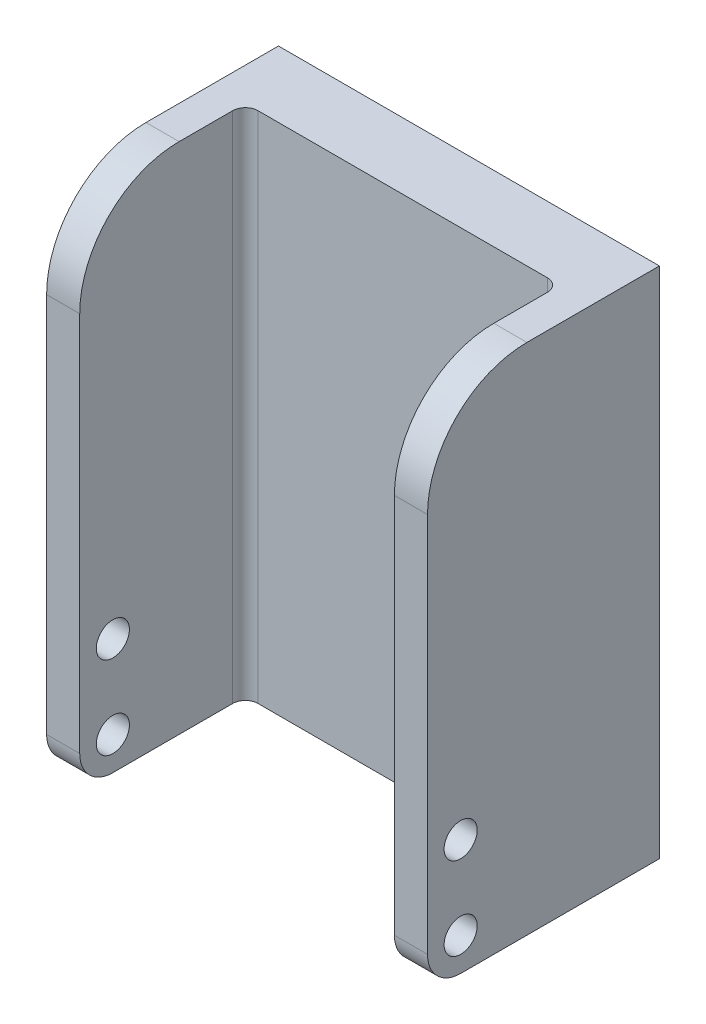
ISO-10303-21;
HEADER;
FILE_DESCRIPTION(('STEP AP214'),'2;1');
FILE_NAME('part.step','',(''),(''),'','','');
FILE_SCHEMA(('AUTOMOTIVE_DESIGN { 1 0 10303 214 1 1 1 1 }'));
ENDSEC;
DATA;
#1=APPLICATION_CONTEXT('core data for automotive mechanical design processes');
#2=APPLICATION_PROTOCOL_DEFINITION('international standard','automotive_design',2000,#1);
#3=PRODUCT_CONTEXT('',#1,'mechanical');
#4=PRODUCT('Part','Part','',(#3));
#5=PRODUCT_RELATED_PRODUCT_CATEGORY('part','',(#4));
#6=PRODUCT_DEFINITION_FORMATION('','',#4);
#7=PRODUCT_DEFINITION_CONTEXT('part definition',#1,'design');
#8=PRODUCT_DEFINITION('design','',#6,#7);
#9=PRODUCT_DEFINITION_SHAPE('','',#8);
#10=(LENGTH_UNIT() NAMED_UNIT(*) SI_UNIT(.MILLI.,.METRE.));
#11=(NAMED_UNIT(*) PLANE_ANGLE_UNIT() SI_UNIT($,.RADIAN.));
#12=(NAMED_UNIT(*) SI_UNIT($,.STERADIAN.) SOLID_ANGLE_UNIT());
#13=UNCERTAINTY_MEASURE_WITH_UNIT(LENGTH_MEASURE(1.E-05),#10,'distance_accuracy_value','');
#14=(GEOMETRIC_REPRESENTATION_CONTEXT(3) GLOBAL_UNCERTAINTY_ASSIGNED_CONTEXT((#13)) GLOBAL_UNIT_ASSIGNED_CONTEXT((#10,
#11,#12)) REPRESENTATION_CONTEXT('',''));
#15=CARTESIAN_POINT('',(0.,0.,0.));
#16=DIRECTION('',(0.,0.,1.));
#17=DIRECTION('',(1.,0.,0.));
#18=AXIS2_PLACEMENT_3D('',#15,#16,#17);
#19=CARTESIAN_POINT('',(0.,0.,4.));
#20=DIRECTION('',(0.,0.,-1.));
#21=DIRECTION('',(-1.,0.,0.));
#22=AXIS2_PLACEMENT_3D('',#19,#20,#21);
#23=PLANE('',#22);
#24=DIRECTION('',(-1.,0.,0.));
#25=VECTOR('',#24,1.);
#26=CARTESIAN_POINT('',(-11.5,15.5,4.));
#27=LINE('',#26,#25);
#28=CARTESIAN_POINT('',(8.738,15.5,4.));
#29=VERTEX_POINT('',#28);
#30=CARTESIAN_POINT('',(-8.738,15.5,4.));
#31=VERTEX_POINT('',#30);
#32=EDGE_CURVE('E172',#29,#31,#27,.T.);
#33=ORIENTED_EDGE('',*,*,#32,.T.);
#34=DIRECTION('',(0.,1.,0.));
#35=VECTOR('',#34,1.);
#36=CARTESIAN_POINT('',(-8.738,-15.5,4.));
#37=LINE('',#36,#35);
#38=CARTESIAN_POINT('',(-8.738,-15.5,4.));
#39=VERTEX_POINT('',#38);
#40=EDGE_CURVE('E230',#31,#39,#37,.F.);
#41=ORIENTED_EDGE('',*,*,#40,.T.);
#42=DIRECTION('',(1.,0.,0.));
#43=VECTOR('',#42,1.);
#44=CARTESIAN_POINT('',(-11.5,-15.5,4.));
#45=LINE('',#44,#43);
#46=CARTESIAN_POINT('',(8.738,-15.5,4.));
#47=VERTEX_POINT('',#46);
#48=EDGE_CURVE('E166',#39,#47,#45,.T.);
#49=ORIENTED_EDGE('',*,*,#48,.T.);
#50=DIRECTION('',(0.,1.,0.));
#51=VECTOR('',#50,1.);
#52=CARTESIAN_POINT('',(8.738,15.5,4.));
#53=LINE('',#52,#51);
#54=EDGE_CURVE('E227',#47,#29,#53,.T.);
#55=ORIENTED_EDGE('',*,*,#54,.T.);
#56=EDGE_LOOP('',(#33,#41,#49,#55));
#57=FACE_BOUND('',#56,.T.);
#58=ADVANCED_FACE('F36',(#57),#23,.F.);
#59=CARTESIAN_POINT('',(11.5,-15.5,4.));
#60=DIRECTION('',(-1.,0.,0.));
#61=DIRECTION('',(0.,0.,1.));
#62=AXIS2_PLACEMENT_3D('',#59,#60,#61);
#63=PLANE('',#62);
#64=CARTESIAN_POINT('',(11.5,-8.5,12.));
#65=DIRECTION('',(1.,0.,0.));
#66=DIRECTION('',(0.,0.,-1.));
#67=AXIS2_PLACEMENT_3D('',#64,#65,#66);
#68=CIRCLE('',#67,1.);
#69=CARTESIAN_POINT('',(11.5,-8.5,11.));
#70=VERTEX_POINT('',#69);
#71=EDGE_CURVE('E279',#70,#70,#68,.T.);
#72=ORIENTED_EDGE('',*,*,#71,.F.);
#73=EDGE_LOOP('',(#72));
#74=FACE_BOUND('',#73,.T.);
#75=CARTESIAN_POINT('',(11.5,-13.5,12.));
#76=DIRECTION('',(1.,0.,0.));
#77=DIRECTION('',(0.,0.,-1.));
#78=AXIS2_PLACEMENT_3D('',#75,#76,#77);
#79=CIRCLE('',#78,1.);
#80=CARTESIAN_POINT('',(11.5,-13.5,11.));
#81=VERTEX_POINT('',#80);
#82=EDGE_CURVE('E273',#81,#81,#79,.T.);
#83=ORIENTED_EDGE('',*,*,#82,.F.);
#84=EDGE_LOOP('',(#83));
#85=FACE_BOUND('',#84,.T.);
#86=DIRECTION('',(0.,0.,-1.));
#87=VECTOR('',#86,1.);
#88=CARTESIAN_POINT('',(11.5,15.5,4.));
#89=LINE('',#88,#87);
#90=CARTESIAN_POINT('',(11.5,15.5,8.));
#91=VERTEX_POINT('',#90);
#92=CARTESIAN_POINT('',(11.5,15.5,0.));
#93=VERTEX_POINT('',#92);
#94=EDGE_CURVE('E136',#91,#93,#89,.T.);
#95=ORIENTED_EDGE('',*,*,#94,.F.);
#96=CARTESIAN_POINT('',(11.5,9.5,8.));
#97=DIRECTION('',(-1.,0.,0.));
#98=DIRECTION('',(0.,0.,1.));
#99=AXIS2_PLACEMENT_3D('',#96,#97,#98);
#100=CIRCLE('',#99,6.);
#101=CARTESIAN_POINT('',(11.5,9.5,14.));
#102=VERTEX_POINT('',#101);
#103=EDGE_CURVE('E217',#91,#102,#100,.F.);
#104=ORIENTED_EDGE('',*,*,#103,.T.);
#105=DIRECTION('',(0.,-1.,0.));
#106=VECTOR('',#105,1.);
#107=CARTESIAN_POINT('',(11.5,15.5,14.));
#108=LINE('',#107,#106);
#109=CARTESIAN_POINT('',(11.5,-13.5,14.));
#110=VERTEX_POINT('',#109);
#111=EDGE_CURVE('E261',#102,#110,#108,.T.);
#112=ORIENTED_EDGE('',*,*,#111,.T.);
#113=CARTESIAN_POINT('',(11.5,-13.5,12.));
#114=DIRECTION('',(-1.,0.,0.));
#115=DIRECTION('',(0.,0.,1.));
#116=AXIS2_PLACEMENT_3D('',#113,#114,#115);
#117=CIRCLE('',#116,2.);
#118=CARTESIAN_POINT('',(11.5,-15.5,12.));
#119=VERTEX_POINT('',#118);
#120=EDGE_CURVE('E201',#110,#119,#117,.F.);
#121=ORIENTED_EDGE('',*,*,#120,.T.);
#122=DIRECTION('',(0.,0.,-1.));
#123=VECTOR('',#122,1.);
#124=CARTESIAN_POINT('',(11.5,-15.5,4.));
#125=LINE('',#124,#123);
#126=CARTESIAN_POINT('',(11.5,-15.5,0.));
#127=VERTEX_POINT('',#126);
#128=EDGE_CURVE('E159',#119,#127,#125,.T.);
#129=ORIENTED_EDGE('',*,*,#128,.T.);
#130=DIRECTION('',(0.,1.,0.));
#131=VECTOR('',#130,1.);
#132=CARTESIAN_POINT('',(11.5,-15.5,0.));
#133=LINE('',#132,#131);
#134=EDGE_CURVE('E153',#127,#93,#133,.T.);
#135=ORIENTED_EDGE('',*,*,#134,.T.);
#136=EDGE_LOOP('',(#95,#104,#112,#121,#129,#135));
#137=FACE_BOUND('',#136,.T.);
#138=ADVANCED_FACE('F157',(#74,#85,#137),#63,.F.);
#139=CARTESIAN_POINT('',(-11.5,15.5,4.));
#140=DIRECTION('',(0.,-1.,0.));
#141=DIRECTION('',(0.,0.,-1.));
#142=AXIS2_PLACEMENT_3D('',#139,#140,#141);
#143=PLANE('',#142);
#144=DIRECTION('',(0.,0.,-1.));
#145=VECTOR('',#144,1.);
#146=CARTESIAN_POINT('',(-11.5,15.5,4.));
#147=LINE('',#146,#145);
#148=CARTESIAN_POINT('',(-11.5,15.5,8.));
#149=VERTEX_POINT('',#148);
#150=CARTESIAN_POINT('',(-11.5,15.5,0.));
#151=VERTEX_POINT('',#150);
#152=EDGE_CURVE('E147',#149,#151,#147,.T.);
#153=ORIENTED_EDGE('',*,*,#152,.F.);
#154=DIRECTION('',(-1.,0.,0.));
#155=VECTOR('',#154,1.);
#156=CARTESIAN_POINT('',(-11.5,15.5,8.));
#157=LINE('',#156,#155);
#158=CARTESIAN_POINT('',(-9.5,15.5,8.));
#159=VERTEX_POINT('',#158);
#160=EDGE_CURVE('E212',#149,#159,#157,.F.);
#161=ORIENTED_EDGE('',*,*,#160,.T.);
#162=DIRECTION('',(0.,0.,1.));
#163=VECTOR('',#162,1.);
#164=CARTESIAN_POINT('',(-9.5,15.5,4.));
#165=LINE('',#164,#163);
#166=CARTESIAN_POINT('',(-9.5,15.5,4.762));
#167=VERTEX_POINT('',#166);
#168=EDGE_CURVE('E257',#167,#159,#165,.T.);
#169=ORIENTED_EDGE('',*,*,#168,.F.);
#170=CARTESIAN_POINT('',(-8.738,15.5,4.762));
#171=DIRECTION('',(0.,-1.,0.));
#172=DIRECTION('',(0.,0.,-1.));
#173=AXIS2_PLACEMENT_3D('',#170,#171,#172);
#174=CIRCLE('',#173,0.762);
#175=EDGE_CURVE('E233',#167,#31,#174,.T.);
#176=ORIENTED_EDGE('',*,*,#175,.T.);
#177=ORIENTED_EDGE('',*,*,#32,.F.);
#178=CARTESIAN_POINT('',(8.738,15.5,4.762));
#179=DIRECTION('',(0.,-1.,0.));
#180=DIRECTION('',(0.,0.,-1.));
#181=AXIS2_PLACEMENT_3D('',#178,#179,#180);
#182=CIRCLE('',#181,0.762);
#183=CARTESIAN_POINT('',(9.5,15.5,4.762));
#184=VERTEX_POINT('',#183);
#185=EDGE_CURVE('E44',#29,#184,#182,.T.);
#186=ORIENTED_EDGE('',*,*,#185,.T.);
#187=DIRECTION('',(0.,0.,1.));
#188=VECTOR('',#187,1.);
#189=CARTESIAN_POINT('',(9.5,15.5,4.));
#190=LINE('',#189,#188);
#191=CARTESIAN_POINT('',(9.5,15.5,8.));
#192=VERTEX_POINT('',#191);
#193=EDGE_CURVE('E262',#184,#192,#190,.T.);
#194=ORIENTED_EDGE('',*,*,#193,.T.);
#195=DIRECTION('',(1.,0.,0.));
#196=VECTOR('',#195,1.);
#197=CARTESIAN_POINT('',(11.5,15.5,8.));
#198=LINE('',#197,#196);
#199=EDGE_CURVE('E143',#192,#91,#198,.T.);
#200=ORIENTED_EDGE('',*,*,#199,.T.);
#201=ORIENTED_EDGE('',*,*,#94,.T.);
#202=DIRECTION('',(-1.,0.,0.));
#203=VECTOR('',#202,1.);
#204=CARTESIAN_POINT('',(-11.5,15.5,0.));
#205=LINE('',#204,#203);
#206=EDGE_CURVE('E140',#93,#151,#205,.T.);
#207=ORIENTED_EDGE('',*,*,#206,.T.);
#208=EDGE_LOOP('',(#153,#161,#169,#176,#177,#186,#194,#200,#201,#207));
#209=FACE_BOUND('',#208,.T.);
#210=ADVANCED_FACE('F139',(#209),#143,.F.);
#211=CARTESIAN_POINT('',(-11.5,-15.5,4.));
#212=DIRECTION('',(1.,0.,0.));
#213=DIRECTION('',(0.,0.,-1.));
#214=AXIS2_PLACEMENT_3D('',#211,#212,#213);
#215=PLANE('',#214);
#216=CARTESIAN_POINT('',(-11.5,-8.5,12.));
#217=DIRECTION('',(1.,0.,0.));
#218=DIRECTION('',(0.,0.,-1.));
#219=AXIS2_PLACEMENT_3D('',#216,#217,#218);
#220=CIRCLE('',#219,1.);
#221=CARTESIAN_POINT('',(-11.5,-8.5,11.));
#222=VERTEX_POINT('',#221);
#223=EDGE_CURVE('E181',#222,#222,#220,.T.);
#224=ORIENTED_EDGE('',*,*,#223,.T.);
#225=EDGE_LOOP('',(#224));
#226=FACE_BOUND('',#225,.T.);
#227=CARTESIAN_POINT('',(-11.5,-13.5,12.));
#228=DIRECTION('',(1.,0.,0.));
#229=DIRECTION('',(0.,0.,-1.));
#230=AXIS2_PLACEMENT_3D('',#227,#228,#229);
#231=CIRCLE('',#230,1.);
#232=CARTESIAN_POINT('',(-11.5,-13.5,11.));
#233=VERTEX_POINT('',#232);
#234=EDGE_CURVE('E276',#233,#233,#231,.T.);
#235=ORIENTED_EDGE('',*,*,#234,.T.);
#236=EDGE_LOOP('',(#235));
#237=FACE_BOUND('',#236,.T.);
#238=DIRECTION('',(0.,-1.,0.));
#239=VECTOR('',#238,1.);
#240=CARTESIAN_POINT('',(-11.5,15.5,14.));
#241=LINE('',#240,#239);
#242=CARTESIAN_POINT('',(-11.5,9.5,14.));
#243=VERTEX_POINT('',#242);
#244=CARTESIAN_POINT('',(-11.5,-13.5,14.));
#245=VERTEX_POINT('',#244);
#246=EDGE_CURVE('E253',#243,#245,#241,.T.);
#247=ORIENTED_EDGE('',*,*,#246,.F.);
#248=CARTESIAN_POINT('',(-11.5,9.5,8.));
#249=DIRECTION('',(1.,0.,0.));
#250=DIRECTION('',(0.,0.,-1.));
#251=AXIS2_PLACEMENT_3D('',#248,#249,#250);
#252=CIRCLE('',#251,6.);
#253=EDGE_CURVE('E209',#243,#149,#252,.F.);
#254=ORIENTED_EDGE('',*,*,#253,.T.);
#255=ORIENTED_EDGE('',*,*,#152,.T.);
#256=DIRECTION('',(0.,-1.,0.));
#257=VECTOR('',#256,1.);
#258=CARTESIAN_POINT('',(-11.5,-15.5,0.));
#259=LINE('',#258,#257);
#260=CARTESIAN_POINT('',(-11.5,-15.5,0.));
#261=VERTEX_POINT('',#260);
#262=EDGE_CURVE('E155',#151,#261,#259,.T.);
#263=ORIENTED_EDGE('',*,*,#262,.T.);
#264=DIRECTION('',(0.,0.,-1.));
#265=VECTOR('',#264,1.);
#266=CARTESIAN_POINT('',(-11.5,-15.5,4.));
#267=LINE('',#266,#265);
#268=CARTESIAN_POINT('',(-11.5,-15.5,12.));
#269=VERTEX_POINT('',#268);
#270=EDGE_CURVE('E174',#269,#261,#267,.T.);
#271=ORIENTED_EDGE('',*,*,#270,.F.);
#272=CARTESIAN_POINT('',(-11.5,-13.5,12.));
#273=DIRECTION('',(1.,0.,0.));
#274=DIRECTION('',(0.,0.,-1.));
#275=AXIS2_PLACEMENT_3D('',#272,#273,#274);
#276=CIRCLE('',#275,2.);
#277=EDGE_CURVE('E190',#269,#245,#276,.F.);
#278=ORIENTED_EDGE('',*,*,#277,.T.);
#279=EDGE_LOOP('',(#247,#254,#255,#263,#271,#278));
#280=FACE_BOUND('',#279,.T.);
#281=ADVANCED_FACE('F285',(#226,#237,#280),#215,.F.);
#282=CARTESIAN_POINT('',(-11.5,-15.5,4.));
#283=DIRECTION('',(0.,1.,0.));
#284=DIRECTION('',(0.,0.,1.));
#285=AXIS2_PLACEMENT_3D('',#282,#283,#284);
#286=PLANE('',#285);
#287=DIRECTION('',(0.,0.,-1.));
#288=VECTOR('',#287,1.);
#289=CARTESIAN_POINT('',(-9.5,-15.5,14.));
#290=LINE('',#289,#288);
#291=CARTESIAN_POINT('',(-9.5,-15.5,12.));
#292=VERTEX_POINT('',#291);
#293=CARTESIAN_POINT('',(-9.5,-15.5,4.762));
#294=VERTEX_POINT('',#293);
#295=EDGE_CURVE('E242',#292,#294,#290,.T.);
#296=ORIENTED_EDGE('',*,*,#295,.F.);
#297=DIRECTION('',(-1.,0.,0.));
#298=VECTOR('',#297,1.);
#299=CARTESIAN_POINT('',(-11.5,-15.5,12.));
#300=LINE('',#299,#298);
#301=EDGE_CURVE('E187',#292,#269,#300,.T.);
#302=ORIENTED_EDGE('',*,*,#301,.T.);
#303=ORIENTED_EDGE('',*,*,#270,.T.);
#304=DIRECTION('',(1.,0.,0.));
#305=VECTOR('',#304,1.);
#306=CARTESIAN_POINT('',(-11.5,-15.5,0.));
#307=LINE('',#306,#305);
#308=EDGE_CURVE('E170',#261,#127,#307,.T.);
#309=ORIENTED_EDGE('',*,*,#308,.T.);
#310=ORIENTED_EDGE('',*,*,#128,.F.);
#311=DIRECTION('',(1.,0.,0.));
#312=VECTOR('',#311,1.);
#313=CARTESIAN_POINT('',(9.5,-15.5,12.));
#314=LINE('',#313,#312);
#315=CARTESIAN_POINT('',(9.5,-15.5,12.));
#316=VERTEX_POINT('',#315);
#317=EDGE_CURVE('E146',#119,#316,#314,.F.);
#318=ORIENTED_EDGE('',*,*,#317,.T.);
#319=DIRECTION('',(0.,0.,-1.));
#320=VECTOR('',#319,1.);
#321=CARTESIAN_POINT('',(9.5,-15.5,14.));
#322=LINE('',#321,#320);
#323=CARTESIAN_POINT('',(9.5,-15.5,4.762));
#324=VERTEX_POINT('',#323);
#325=EDGE_CURVE('E161',#316,#324,#322,.T.);
#326=ORIENTED_EDGE('',*,*,#325,.T.);
#327=CARTESIAN_POINT('',(8.738,-15.5,4.762));
#328=DIRECTION('',(0.,1.,0.));
#329=DIRECTION('',(0.,0.,1.));
#330=AXIS2_PLACEMENT_3D('',#327,#328,#329);
#331=CIRCLE('',#330,0.762);
#332=EDGE_CURVE('E11',#324,#47,#331,.T.);
#333=ORIENTED_EDGE('',*,*,#332,.T.);
#334=ORIENTED_EDGE('',*,*,#48,.F.);
#335=CARTESIAN_POINT('',(-8.738,-15.5,4.762));
#336=DIRECTION('',(0.,1.,0.));
#337=DIRECTION('',(0.,0.,1.));
#338=AXIS2_PLACEMENT_3D('',#335,#336,#337);
#339=CIRCLE('',#338,0.762);
#340=EDGE_CURVE('E235',#39,#294,#339,.T.);
#341=ORIENTED_EDGE('',*,*,#340,.T.);
#342=EDGE_LOOP('',(#296,#302,#303,#309,#310,#318,#326,#333,#334,#341));
#343=FACE_BOUND('',#342,.T.);
#344=ADVANCED_FACE('F241',(#343),#286,.F.);
#345=CARTESIAN_POINT('',(0.,0.,0.));
#346=DIRECTION('',(0.,0.,-1.));
#347=DIRECTION('',(-1.,0.,0.));
#348=AXIS2_PLACEMENT_3D('',#345,#346,#347);
#349=PLANE('',#348);
#350=ORIENTED_EDGE('',*,*,#134,.F.);
#351=ORIENTED_EDGE('',*,*,#308,.F.);
#352=ORIENTED_EDGE('',*,*,#262,.F.);
#353=ORIENTED_EDGE('',*,*,#206,.F.);
#354=EDGE_LOOP('',(#350,#351,#352,#353));
#355=FACE_BOUND('',#354,.T.);
#356=ADVANCED_FACE('F151',(#355),#349,.T.);
#357=CARTESIAN_POINT('',(9.5,15.5,14.));
#358=DIRECTION('',(0.,0.,1.));
#359=DIRECTION('',(0.,-1.,0.));
#360=AXIS2_PLACEMENT_3D('',#357,#358,#359);
#361=PLANE('',#360);
#362=ORIENTED_EDGE('',*,*,#111,.F.);
#363=DIRECTION('',(1.,0.,0.));
#364=VECTOR('',#363,1.);
#365=CARTESIAN_POINT('',(9.5,9.5,14.));
#366=LINE('',#365,#364);
#367=CARTESIAN_POINT('',(9.5,9.5,14.));
#368=VERTEX_POINT('',#367);
#369=EDGE_CURVE('E219',#102,#368,#366,.F.);
#370=ORIENTED_EDGE('',*,*,#369,.T.);
#371=DIRECTION('',(0.,-1.,0.));
#372=VECTOR('',#371,1.);
#373=CARTESIAN_POINT('',(9.5,15.5,14.));
#374=LINE('',#373,#372);
#375=CARTESIAN_POINT('',(9.5,-13.5,14.));
#376=VERTEX_POINT('',#375);
#377=EDGE_CURVE('E163',#368,#376,#374,.T.);
#378=ORIENTED_EDGE('',*,*,#377,.T.);
#379=DIRECTION('',(1.,0.,0.));
#380=VECTOR('',#379,1.);
#381=CARTESIAN_POINT('',(11.5,-13.5,14.));
#382=LINE('',#381,#380);
#383=EDGE_CURVE('E198',#376,#110,#382,.T.);
#384=ORIENTED_EDGE('',*,*,#383,.T.);
#385=EDGE_LOOP('',(#362,#370,#378,#384));
#386=FACE_BOUND('',#385,.T.);
#387=ADVANCED_FACE('F320',(#386),#361,.T.);
#388=CARTESIAN_POINT('',(9.5,0.,0.));
#389=DIRECTION('',(1.,0.,0.));
#390=DIRECTION('',(0.,0.,-1.));
#391=AXIS2_PLACEMENT_3D('',#388,#389,#390);
#392=PLANE('',#391);
#393=CARTESIAN_POINT('',(9.5,-8.5,12.));
#394=DIRECTION('',(1.,0.,0.));
#395=DIRECTION('',(0.,0.,-1.));
#396=AXIS2_PLACEMENT_3D('',#393,#394,#395);
#397=CIRCLE('',#396,1.);
#398=CARTESIAN_POINT('',(9.5,-8.5,11.));
#399=VERTEX_POINT('',#398);
#400=EDGE_CURVE('E185',#399,#399,#397,.T.);
#401=ORIENTED_EDGE('',*,*,#400,.T.);
#402=EDGE_LOOP('',(#401));
#403=FACE_BOUND('',#402,.T.);
#404=CARTESIAN_POINT('',(9.5,-13.5,12.));
#405=DIRECTION('',(1.,0.,0.));
#406=DIRECTION('',(0.,0.,-1.));
#407=AXIS2_PLACEMENT_3D('',#404,#405,#406);
#408=CIRCLE('',#407,1.);
#409=CARTESIAN_POINT('',(9.5,-13.5,11.));
#410=VERTEX_POINT('',#409);
#411=EDGE_CURVE('E180',#410,#410,#408,.T.);
#412=ORIENTED_EDGE('',*,*,#411,.T.);
#413=EDGE_LOOP('',(#412));
#414=FACE_BOUND('',#413,.T.);
#415=ORIENTED_EDGE('',*,*,#193,.F.);
#416=DIRECTION('',(0.,1.,0.));
#417=VECTOR('',#416,1.);
#418=CARTESIAN_POINT('',(9.5,-15.5,4.762));
#419=LINE('',#418,#417);
#420=EDGE_CURVE('E51',#184,#324,#419,.F.);
#421=ORIENTED_EDGE('',*,*,#420,.T.);
#422=ORIENTED_EDGE('',*,*,#325,.F.);
#423=CARTESIAN_POINT('',(9.5,-13.5,12.));
#424=DIRECTION('',(1.,0.,0.));
#425=DIRECTION('',(0.,0.,-1.));
#426=AXIS2_PLACEMENT_3D('',#423,#424,#425);
#427=CIRCLE('',#426,2.);
#428=EDGE_CURVE('E203',#316,#376,#427,.F.);
#429=ORIENTED_EDGE('',*,*,#428,.T.);
#430=ORIENTED_EDGE('',*,*,#377,.F.);
#431=CARTESIAN_POINT('',(9.5,9.5,8.));
#432=DIRECTION('',(1.,0.,0.));
#433=DIRECTION('',(0.,0.,-1.));
#434=AXIS2_PLACEMENT_3D('',#431,#432,#433);
#435=CIRCLE('',#434,6.);
#436=EDGE_CURVE('E221',#368,#192,#435,.F.);
#437=ORIENTED_EDGE('',*,*,#436,.T.);
#438=EDGE_LOOP('',(#415,#421,#422,#429,#430,#437));
#439=FACE_BOUND('',#438,.T.);
#440=ADVANCED_FACE('F355',(#403,#414,#439),#392,.F.);
#441=CARTESIAN_POINT('',(-9.5,15.5,14.));
#442=DIRECTION('',(0.,0.,-1.));
#443=DIRECTION('',(0.,1.,0.));
#444=AXIS2_PLACEMENT_3D('',#441,#442,#443);
#445=PLANE('',#444);
#446=DIRECTION('',(0.,-1.,0.));
#447=VECTOR('',#446,1.);
#448=CARTESIAN_POINT('',(-9.5,15.5,14.));
#449=LINE('',#448,#447);
#450=CARTESIAN_POINT('',(-9.5,9.5,14.));
#451=VERTEX_POINT('',#450);
#452=CARTESIAN_POINT('',(-9.5,-13.5,14.));
#453=VERTEX_POINT('',#452);
#454=EDGE_CURVE('E252',#451,#453,#449,.T.);
#455=ORIENTED_EDGE('',*,*,#454,.F.);
#456=DIRECTION('',(-1.,0.,0.));
#457=VECTOR('',#456,1.);
#458=CARTESIAN_POINT('',(-9.5,9.5,14.));
#459=LINE('',#458,#457);
#460=EDGE_CURVE('E206',#451,#243,#459,.T.);
#461=ORIENTED_EDGE('',*,*,#460,.T.);
#462=ORIENTED_EDGE('',*,*,#246,.T.);
#463=DIRECTION('',(-1.,0.,0.));
#464=VECTOR('',#463,1.);
#465=CARTESIAN_POINT('',(-9.5,-13.5,14.));
#466=LINE('',#465,#464);
#467=EDGE_CURVE('E193',#245,#453,#466,.F.);
#468=ORIENTED_EDGE('',*,*,#467,.T.);
#469=EDGE_LOOP('',(#455,#461,#462,#468));
#470=FACE_BOUND('',#469,.T.);
#471=ADVANCED_FACE('F299',(#470),#445,.F.);
#472=CARTESIAN_POINT('',(-9.5,0.,0.));
#473=DIRECTION('',(-1.,0.,0.));
#474=DIRECTION('',(0.,0.,-1.));
#475=AXIS2_PLACEMENT_3D('',#472,#473,#474);
#476=PLANE('',#475);
#477=CARTESIAN_POINT('',(-9.5,-8.5,12.));
#478=DIRECTION('',(-1.,0.,0.));
#479=DIRECTION('',(0.,0.,1.));
#480=AXIS2_PLACEMENT_3D('',#477,#478,#479);
#481=CIRCLE('',#480,1.);
#482=CARTESIAN_POINT('',(-9.5,-8.5,13.));
#483=VERTEX_POINT('',#482);
#484=EDGE_CURVE('E182',#483,#483,#481,.T.);
#485=ORIENTED_EDGE('',*,*,#484,.T.);
#486=EDGE_LOOP('',(#485));
#487=FACE_BOUND('',#486,.T.);
#488=CARTESIAN_POINT('',(-9.5,-13.5,12.));
#489=DIRECTION('',(-1.,0.,0.));
#490=DIRECTION('',(0.,0.,1.));
#491=AXIS2_PLACEMENT_3D('',#488,#489,#490);
#492=CIRCLE('',#491,1.);
#493=CARTESIAN_POINT('',(-9.5,-13.5,13.));
#494=VERTEX_POINT('',#493);
#495=EDGE_CURVE('E177',#494,#494,#492,.T.);
#496=ORIENTED_EDGE('',*,*,#495,.T.);
#497=EDGE_LOOP('',(#496));
#498=FACE_BOUND('',#497,.T.);
#499=ORIENTED_EDGE('',*,*,#295,.T.);
#500=DIRECTION('',(0.,1.,0.));
#501=VECTOR('',#500,1.);
#502=CARTESIAN_POINT('',(-9.5,15.5,4.762));
#503=LINE('',#502,#501);
#504=EDGE_CURVE('E224',#294,#167,#503,.T.);
#505=ORIENTED_EDGE('',*,*,#504,.T.);
#506=ORIENTED_EDGE('',*,*,#168,.T.);
#507=CARTESIAN_POINT('',(-9.5,9.5,8.));
#508=DIRECTION('',(-1.,0.,0.));
#509=DIRECTION('',(0.,0.,1.));
#510=AXIS2_PLACEMENT_3D('',#507,#508,#509);
#511=CIRCLE('',#510,6.);
#512=EDGE_CURVE('E215',#159,#451,#511,.F.);
#513=ORIENTED_EDGE('',*,*,#512,.T.);
#514=ORIENTED_EDGE('',*,*,#454,.T.);
#515=CARTESIAN_POINT('',(-9.5,-13.5,12.));
#516=DIRECTION('',(-1.,0.,0.));
#517=DIRECTION('',(0.,0.,1.));
#518=AXIS2_PLACEMENT_3D('',#515,#516,#517);
#519=CIRCLE('',#518,2.);
#520=EDGE_CURVE('E196',#453,#292,#519,.F.);
#521=ORIENTED_EDGE('',*,*,#520,.T.);
#522=EDGE_LOOP('',(#499,#505,#506,#513,#514,#521));
#523=FACE_BOUND('',#522,.T.);
#524=ADVANCED_FACE('F249',(#487,#498,#523),#476,.F.);
#525=CARTESIAN_POINT('',(-11.5,-13.5,12.));
#526=DIRECTION('',(1.,0.,0.));
#527=DIRECTION('',(0.,0.,-1.));
#528=AXIS2_PLACEMENT_3D('',#525,#526,#527);
#529=CYLINDRICAL_SURFACE('',#528,1.);
#530=ORIENTED_EDGE('',*,*,#234,.F.);
#531=EDGE_LOOP('',(#530));
#532=FACE_BOUND('',#531,.T.);
#533=ORIENTED_EDGE('',*,*,#495,.F.);
#534=EDGE_LOOP('',(#533));
#535=FACE_BOUND('',#534,.T.);
#536=ADVANCED_FACE('F292',(#532,#535),#529,.F.);
#537=CARTESIAN_POINT('',(-11.5,-8.5,12.));
#538=DIRECTION('',(1.,0.,0.));
#539=DIRECTION('',(0.,0.,-1.));
#540=AXIS2_PLACEMENT_3D('',#537,#538,#539);
#541=CYLINDRICAL_SURFACE('',#540,1.);
#542=ORIENTED_EDGE('',*,*,#223,.F.);
#543=EDGE_LOOP('',(#542));
#544=FACE_BOUND('',#543,.T.);
#545=ORIENTED_EDGE('',*,*,#484,.F.);
#546=EDGE_LOOP('',(#545));
#547=FACE_BOUND('',#546,.T.);
#548=ADVANCED_FACE('F288',(#544,#547),#541,.F.);
#549=ORIENTED_EDGE('',*,*,#82,.T.);
#550=EDGE_LOOP('',(#549));
#551=FACE_BOUND('',#550,.T.);
#552=ORIENTED_EDGE('',*,*,#411,.F.);
#553=EDGE_LOOP('',(#552));
#554=FACE_BOUND('',#553,.T.);
#555=ADVANCED_FACE('F291',(#551,#554),#529,.F.);
#556=ORIENTED_EDGE('',*,*,#71,.T.);
#557=EDGE_LOOP('',(#556));
#558=FACE_BOUND('',#557,.T.);
#559=ORIENTED_EDGE('',*,*,#400,.F.);
#560=EDGE_LOOP('',(#559));
#561=FACE_BOUND('',#560,.T.);
#562=ADVANCED_FACE('F294',(#558,#561),#541,.F.);
#563=CARTESIAN_POINT('',(-11.5,-13.5,12.));
#564=DIRECTION('',(-1.,0.,0.));
#565=DIRECTION('',(0.,0.,1.));
#566=AXIS2_PLACEMENT_3D('',#563,#564,#565);
#567=CYLINDRICAL_SURFACE('',#566,2.);
#568=ORIENTED_EDGE('',*,*,#520,.F.);
#569=ORIENTED_EDGE('',*,*,#467,.F.);
#570=ORIENTED_EDGE('',*,*,#277,.F.);
#571=ORIENTED_EDGE('',*,*,#301,.F.);
#572=EDGE_LOOP('',(#568,#569,#570,#571));
#573=FACE_BOUND('',#572,.T.);
#574=ADVANCED_FACE('F330',(#573),#567,.T.);
#575=CARTESIAN_POINT('',(9.5,-13.5,12.));
#576=DIRECTION('',(-1.,0.,0.));
#577=DIRECTION('',(0.,0.,1.));
#578=AXIS2_PLACEMENT_3D('',#575,#576,#577);
#579=CYLINDRICAL_SURFACE('',#578,2.);
#580=ORIENTED_EDGE('',*,*,#428,.F.);
#581=ORIENTED_EDGE('',*,*,#317,.F.);
#582=ORIENTED_EDGE('',*,*,#120,.F.);
#583=ORIENTED_EDGE('',*,*,#383,.F.);
#584=EDGE_LOOP('',(#580,#581,#582,#583));
#585=FACE_BOUND('',#584,.T.);
#586=ADVANCED_FACE('F333',(#585),#579,.T.);
#587=CARTESIAN_POINT('',(-9.5,9.5,8.));
#588=DIRECTION('',(-1.,0.,0.));
#589=DIRECTION('',(0.,0.,1.));
#590=AXIS2_PLACEMENT_3D('',#587,#588,#589);
#591=CYLINDRICAL_SURFACE('',#590,6.);
#592=ORIENTED_EDGE('',*,*,#512,.F.);
#593=ORIENTED_EDGE('',*,*,#160,.F.);
#594=ORIENTED_EDGE('',*,*,#253,.F.);
#595=ORIENTED_EDGE('',*,*,#460,.F.);
#596=EDGE_LOOP('',(#592,#593,#594,#595));
#597=FACE_BOUND('',#596,.T.);
#598=ADVANCED_FACE('F337',(#597),#591,.T.);
#599=CARTESIAN_POINT('',(-11.5,9.5,8.));
#600=DIRECTION('',(-1.,0.,0.));
#601=DIRECTION('',(0.,0.,1.));
#602=AXIS2_PLACEMENT_3D('',#599,#600,#601);
#603=CYLINDRICAL_SURFACE('',#602,6.);
#604=ORIENTED_EDGE('',*,*,#436,.F.);
#605=ORIENTED_EDGE('',*,*,#369,.F.);
#606=ORIENTED_EDGE('',*,*,#103,.F.);
#607=ORIENTED_EDGE('',*,*,#199,.F.);
#608=EDGE_LOOP('',(#604,#605,#606,#607));
#609=FACE_BOUND('',#608,.T.);
#610=ADVANCED_FACE('F341',(#609),#603,.T.);
#611=CARTESIAN_POINT('',(-8.738,0.,4.762));
#612=DIRECTION('',(0.,-1.,0.));
#613=DIRECTION('',(0.,0.,-1.));
#614=AXIS2_PLACEMENT_3D('',#611,#612,#613);
#615=CYLINDRICAL_SURFACE('',#614,0.762);
#616=ORIENTED_EDGE('',*,*,#340,.F.);
#617=ORIENTED_EDGE('',*,*,#40,.F.);
#618=ORIENTED_EDGE('',*,*,#175,.F.);
#619=ORIENTED_EDGE('',*,*,#504,.F.);
#620=EDGE_LOOP('',(#616,#617,#618,#619));
#621=FACE_BOUND('',#620,.T.);
#622=ADVANCED_FACE('F255',(#621),#615,.F.);
#623=CARTESIAN_POINT('',(8.738,0.,4.762));
#624=DIRECTION('',(0.,-1.,0.));
#625=DIRECTION('',(0.,0.,-1.));
#626=AXIS2_PLACEMENT_3D('',#623,#624,#625);
#627=CYLINDRICAL_SURFACE('',#626,0.762);
#628=ORIENTED_EDGE('',*,*,#332,.F.);
#629=ORIENTED_EDGE('',*,*,#420,.F.);
#630=ORIENTED_EDGE('',*,*,#185,.F.);
#631=ORIENTED_EDGE('',*,*,#54,.F.);
#632=EDGE_LOOP('',(#628,#629,#630,#631));
#633=FACE_BOUND('',#632,.T.);
#634=ADVANCED_FACE('F38',(#633),#627,.F.);
#635=CLOSED_SHELL('',(#58,#138,#210,#281,#344,#356,#387,#440,#471,#524,#536,#548,#555,#562,#574,
#586,#598,#610,#622,#634));
#636=MANIFOLD_SOLID_BREP('B2',#635);
#637=ADVANCED_BREP_SHAPE_REPRESENTATION('',(#18,#636),#14);
#638=SHAPE_DEFINITION_REPRESENTATION(#9,#637);
ENDSEC;
END-ISO-10303-21;
